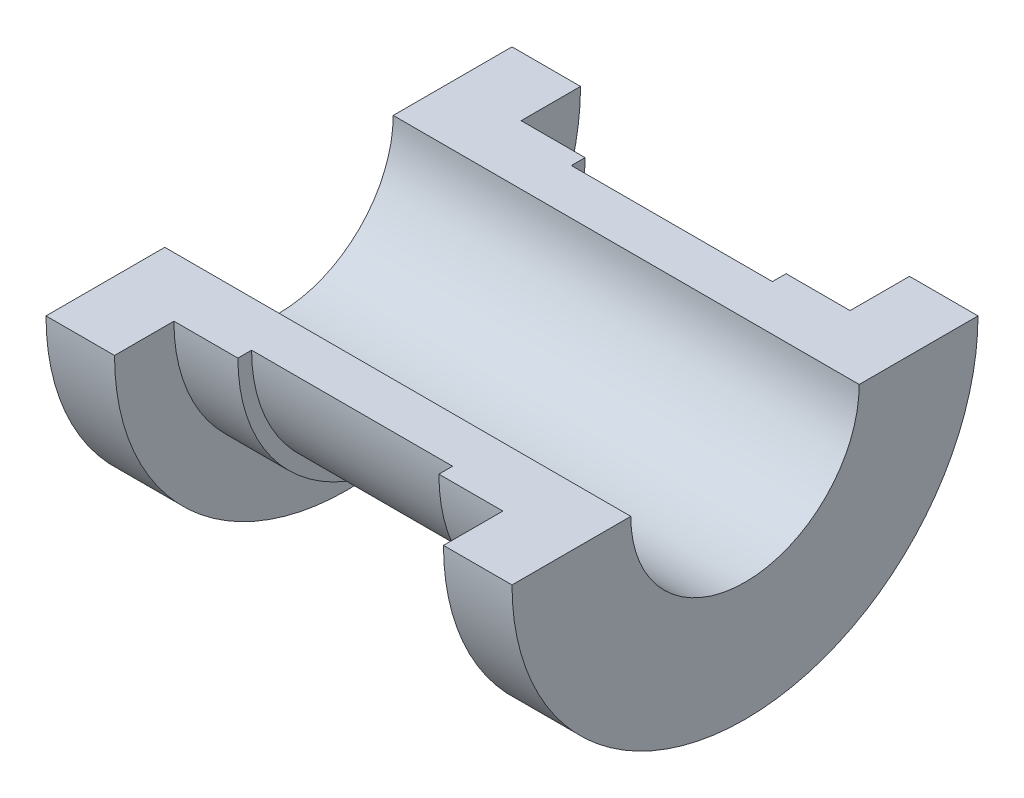
ISO-10303-21;
HEADER;
FILE_DESCRIPTION(('STEP AP214'),'2;1');
FILE_NAME('part.step','',(''),(''),'','','');
FILE_SCHEMA(('AUTOMOTIVE_DESIGN { 1 0 10303 214 1 1 1 1 }'));
ENDSEC;
DATA;
#1=APPLICATION_CONTEXT('core data for automotive mechanical design processes');
#2=APPLICATION_PROTOCOL_DEFINITION('international standard','automotive_design',2000,#1);
#3=PRODUCT_CONTEXT('',#1,'mechanical');
#4=PRODUCT('Part','Part','',(#3));
#5=PRODUCT_RELATED_PRODUCT_CATEGORY('part','',(#4));
#6=PRODUCT_DEFINITION_FORMATION('','',#4);
#7=PRODUCT_DEFINITION_CONTEXT('part definition',#1,'design');
#8=PRODUCT_DEFINITION('design','',#6,#7);
#9=PRODUCT_DEFINITION_SHAPE('','',#8);
#10=(LENGTH_UNIT() NAMED_UNIT(*) SI_UNIT(.MILLI.,.METRE.));
#11=(NAMED_UNIT(*) PLANE_ANGLE_UNIT() SI_UNIT($,.RADIAN.));
#12=(NAMED_UNIT(*) SI_UNIT($,.STERADIAN.) SOLID_ANGLE_UNIT());
#13=UNCERTAINTY_MEASURE_WITH_UNIT(LENGTH_MEASURE(1.E-05),#10,'distance_accuracy_value','');
#14=(GEOMETRIC_REPRESENTATION_CONTEXT(3) GLOBAL_UNCERTAINTY_ASSIGNED_CONTEXT((#13)) GLOBAL_UNIT_ASSIGNED_CONTEXT((#10,
#11,#12)) REPRESENTATION_CONTEXT('',''));
#15=CARTESIAN_POINT('',(0.,0.,0.));
#16=DIRECTION('',(0.,0.,1.));
#17=DIRECTION('',(1.,0.,0.));
#18=AXIS2_PLACEMENT_3D('',#15,#16,#17);
#19=CARTESIAN_POINT('',(25.5,0.,-12.5));
#20=DIRECTION('',(1.,0.,0.));
#21=DIRECTION('',(0.,0.,-1.));
#22=AXIS2_PLACEMENT_3D('',#19,#20,#21);
#23=PLANE('',#22);
#24=CARTESIAN_POINT('',(25.5,0.,0.));
#25=DIRECTION('',(-1.,0.,0.));
#26=DIRECTION('',(0.,0.,1.));
#27=AXIS2_PLACEMENT_3D('',#24,#25,#26);
#28=CIRCLE('',#27,25.5);
#29=CARTESIAN_POINT('',(25.5,0.,-25.5));
#30=VERTEX_POINT('',#29);
#31=CARTESIAN_POINT('',(25.5,0.,25.5));
#32=VERTEX_POINT('',#31);
#33=EDGE_CURVE('E50',#30,#32,#28,.T.);
#34=ORIENTED_EDGE('',*,*,#33,.F.);
#35=DIRECTION('',(0.,0.,1.));
#36=VECTOR('',#35,1.);
#37=CARTESIAN_POINT('',(25.5,0.,-12.5));
#38=LINE('',#37,#36);
#39=CARTESIAN_POINT('',(25.5,0.,-12.5));
#40=VERTEX_POINT('',#39);
#41=EDGE_CURVE('E133',#30,#40,#38,.T.);
#42=ORIENTED_EDGE('',*,*,#41,.T.);
#43=CARTESIAN_POINT('',(25.5,0.,0.));
#44=DIRECTION('',(-1.,0.,0.));
#45=DIRECTION('',(0.,0.,1.));
#46=AXIS2_PLACEMENT_3D('',#43,#44,#45);
#47=CIRCLE('',#46,12.5);
#48=CARTESIAN_POINT('',(25.5,0.,12.5));
#49=VERTEX_POINT('',#48);
#50=EDGE_CURVE('E128',#40,#49,#47,.T.);
#51=ORIENTED_EDGE('',*,*,#50,.T.);
#52=DIRECTION('',(0.,0.,-1.));
#53=VECTOR('',#52,1.);
#54=CARTESIAN_POINT('',(25.5,0.,12.5));
#55=LINE('',#54,#53);
#56=EDGE_CURVE('E131',#32,#49,#55,.T.);
#57=ORIENTED_EDGE('',*,*,#56,.F.);
#58=EDGE_LOOP('',(#34,#42,#51,#57));
#59=FACE_BOUND('',#58,.T.);
#60=ADVANCED_FACE('F38',(#59),#23,.T.);
#61=CARTESIAN_POINT('',(0.,0.,0.));
#62=DIRECTION('',(-1.,0.,0.));
#63=DIRECTION('',(0.,0.,1.));
#64=AXIS2_PLACEMENT_3D('',#61,#62,#63);
#65=CYLINDRICAL_SURFACE('',#64,25.5);
#66=CARTESIAN_POINT('',(18.,0.,0.));
#67=DIRECTION('',(-1.,0.,0.));
#68=DIRECTION('',(0.,0.,1.));
#69=AXIS2_PLACEMENT_3D('',#66,#67,#68);
#70=CIRCLE('',#69,25.5);
#71=CARTESIAN_POINT('',(18.,0.,-25.5));
#72=VERTEX_POINT('',#71);
#73=CARTESIAN_POINT('',(18.,0.,25.5));
#74=VERTEX_POINT('',#73);
#75=EDGE_CURVE('E63',#72,#74,#70,.T.);
#76=ORIENTED_EDGE('',*,*,#75,.F.);
#77=DIRECTION('',(1.,0.,0.));
#78=VECTOR('',#77,1.);
#79=CARTESIAN_POINT('',(25.5,0.,-25.5));
#80=LINE('',#79,#78);
#81=EDGE_CURVE('E138',#72,#30,#80,.T.);
#82=ORIENTED_EDGE('',*,*,#81,.T.);
#83=ORIENTED_EDGE('',*,*,#33,.T.);
#84=DIRECTION('',(1.,0.,0.));
#85=VECTOR('',#84,1.);
#86=CARTESIAN_POINT('',(25.5,0.,25.5));
#87=LINE('',#86,#85);
#88=EDGE_CURVE('E151',#74,#32,#87,.T.);
#89=ORIENTED_EDGE('',*,*,#88,.F.);
#90=EDGE_LOOP('',(#76,#82,#83,#89));
#91=FACE_BOUND('',#90,.T.);
#92=ADVANCED_FACE('F40',(#91),#65,.T.);
#93=CARTESIAN_POINT('',(18.,0.,-25.5));
#94=DIRECTION('',(-1.,0.,0.));
#95=DIRECTION('',(0.,0.,1.));
#96=AXIS2_PLACEMENT_3D('',#93,#94,#95);
#97=PLANE('',#96);
#98=CARTESIAN_POINT('',(18.,0.,0.));
#99=DIRECTION('',(-1.,0.,0.));
#100=DIRECTION('',(0.,0.,1.));
#101=AXIS2_PLACEMENT_3D('',#98,#99,#100);
#102=CIRCLE('',#101,19.);
#103=CARTESIAN_POINT('',(18.,0.,-19.));
#104=VERTEX_POINT('',#103);
#105=CARTESIAN_POINT('',(18.,0.,19.));
#106=VERTEX_POINT('',#105);
#107=EDGE_CURVE('E232',#104,#106,#102,.T.);
#108=ORIENTED_EDGE('',*,*,#107,.F.);
#109=DIRECTION('',(0.,0.,-1.));
#110=VECTOR('',#109,1.);
#111=CARTESIAN_POINT('',(18.,0.,-25.5));
#112=LINE('',#111,#110);
#113=EDGE_CURVE('E214',#104,#72,#112,.T.);
#114=ORIENTED_EDGE('',*,*,#113,.T.);
#115=ORIENTED_EDGE('',*,*,#75,.T.);
#116=DIRECTION('',(0.,0.,1.));
#117=VECTOR('',#116,1.);
#118=CARTESIAN_POINT('',(18.,0.,25.5));
#119=LINE('',#118,#117);
#120=EDGE_CURVE('E184',#106,#74,#119,.T.);
#121=ORIENTED_EDGE('',*,*,#120,.F.);
#122=EDGE_LOOP('',(#108,#114,#115,#121));
#123=FACE_BOUND('',#122,.T.);
#124=ADVANCED_FACE('F307',(#123),#97,.T.);
#125=CARTESIAN_POINT('',(0.,0.,0.));
#126=DIRECTION('',(-1.,0.,0.));
#127=DIRECTION('',(0.,0.,1.));
#128=AXIS2_PLACEMENT_3D('',#125,#126,#127);
#129=CYLINDRICAL_SURFACE('',#128,19.);
#130=CARTESIAN_POINT('',(11.,0.,0.));
#131=DIRECTION('',(-1.,0.,0.));
#132=DIRECTION('',(0.,0.,1.));
#133=AXIS2_PLACEMENT_3D('',#130,#131,#132);
#134=CIRCLE('',#133,19.);
#135=CARTESIAN_POINT('',(11.,0.,-19.));
#136=VERTEX_POINT('',#135);
#137=CARTESIAN_POINT('',(11.,0.,19.));
#138=VERTEX_POINT('',#137);
#139=EDGE_CURVE('E230',#136,#138,#134,.T.);
#140=ORIENTED_EDGE('',*,*,#139,.F.);
#141=DIRECTION('',(1.,0.,0.));
#142=VECTOR('',#141,1.);
#143=CARTESIAN_POINT('',(18.,0.,-19.));
#144=LINE('',#143,#142);
#145=EDGE_CURVE('E211',#136,#104,#144,.T.);
#146=ORIENTED_EDGE('',*,*,#145,.T.);
#147=ORIENTED_EDGE('',*,*,#107,.T.);
#148=DIRECTION('',(1.,0.,0.));
#149=VECTOR('',#148,1.);
#150=CARTESIAN_POINT('',(18.,0.,19.));
#151=LINE('',#150,#149);
#152=EDGE_CURVE('E181',#138,#106,#151,.T.);
#153=ORIENTED_EDGE('',*,*,#152,.F.);
#154=EDGE_LOOP('',(#140,#146,#147,#153));
#155=FACE_BOUND('',#154,.T.);
#156=ADVANCED_FACE('F304',(#155),#129,.T.);
#157=CARTESIAN_POINT('',(11.,0.,-19.));
#158=DIRECTION('',(-1.,0.,0.));
#159=DIRECTION('',(0.,0.,1.));
#160=AXIS2_PLACEMENT_3D('',#157,#158,#159);
#161=PLANE('',#160);
#162=CARTESIAN_POINT('',(11.,0.,0.));
#163=DIRECTION('',(-1.,0.,0.));
#164=DIRECTION('',(0.,0.,1.));
#165=AXIS2_PLACEMENT_3D('',#162,#163,#164);
#166=CIRCLE('',#165,17.5);
#167=CARTESIAN_POINT('',(11.,0.,-17.5));
#168=VERTEX_POINT('',#167);
#169=CARTESIAN_POINT('',(11.,0.,17.5));
#170=VERTEX_POINT('',#169);
#171=EDGE_CURVE('E228',#168,#170,#166,.T.);
#172=ORIENTED_EDGE('',*,*,#171,.F.);
#173=DIRECTION('',(0.,0.,-1.));
#174=VECTOR('',#173,1.);
#175=CARTESIAN_POINT('',(11.,0.,-19.));
#176=LINE('',#175,#174);
#177=EDGE_CURVE('E208',#168,#136,#176,.T.);
#178=ORIENTED_EDGE('',*,*,#177,.T.);
#179=ORIENTED_EDGE('',*,*,#139,.T.);
#180=DIRECTION('',(0.,0.,1.));
#181=VECTOR('',#180,1.);
#182=CARTESIAN_POINT('',(11.,0.,19.));
#183=LINE('',#182,#181);
#184=EDGE_CURVE('E178',#170,#138,#183,.T.);
#185=ORIENTED_EDGE('',*,*,#184,.F.);
#186=EDGE_LOOP('',(#172,#178,#179,#185));
#187=FACE_BOUND('',#186,.T.);
#188=ADVANCED_FACE('F301',(#187),#161,.T.);
#189=CARTESIAN_POINT('',(0.,0.,0.));
#190=DIRECTION('',(-1.,0.,0.));
#191=DIRECTION('',(0.,0.,1.));
#192=AXIS2_PLACEMENT_3D('',#189,#190,#191);
#193=CYLINDRICAL_SURFACE('',#192,17.5);
#194=CARTESIAN_POINT('',(0.,-17.2434862639043,2.98532769835149));
#195=CARTESIAN_POINT('',(-0.393250882339083,-17.243440773825,2.98559045260708));
#196=CARTESIAN_POINT('',(-0.781759879061474,-17.2571008429751,2.90950813701106));
#197=CARTESIAN_POINT('',(-1.51107048678248,-17.3047039270003,2.61151088506312));
#198=CARTESIAN_POINT('',(-1.83907500398646,-17.3374866995625,2.39593028336162));
#199=CARTESIAN_POINT('',(-2.40153121465639,-17.4054597338849,1.8381780197645));
#200=CARTESIAN_POINT('',(-2.61999696772943,-17.4383946077719,1.51157635169592));
#201=CARTESIAN_POINT('',(-2.9221664876013,-17.4861631645221,0.785218025191185));
#202=CARTESIAN_POINT('',(-2.99978309080483,-17.4999747284957,0.394490958287499));
#203=CARTESIAN_POINT('',(-3.00020313103649,-17.5000251994827,-0.392245626652773));
#204=CARTESIAN_POINT('',(-2.92233201420616,-17.4861935264983,-0.78410277436104));
#205=CARTESIAN_POINT('',(-2.62165153745049,-17.4386345936882,-1.5085770496508));
#206=CARTESIAN_POINT('',(-2.40032413043669,-17.4053220941262,-1.83909902073129));
#207=CARTESIAN_POINT('',(-1.84342457074535,-17.3380065042287,-2.39187225153384));
#208=CARTESIAN_POINT('',(-1.51348120622272,-17.3048706613046,-2.61042075372896));
#209=CARTESIAN_POINT('',(-0.784003911064598,-17.2572004955497,-2.90893041724563));
#210=CARTESIAN_POINT('',(-0.395104830968694,-17.2435181087001,-2.98514375608328));
#211=CARTESIAN_POINT('',(0.393613175412539,-17.2434847658635,-2.9853363527388));
#212=CARTESIAN_POINT('',(0.783376866372402,-17.2571907578095,-2.90895717093594));
#213=CARTESIAN_POINT('',(1.5113813405387,-17.3046829255837,-2.61163043303959));
#214=CARTESIAN_POINT('',(1.84278628882435,-17.3379189202925,-2.39244434106502));
#215=CARTESIAN_POINT('',(2.39890969888057,-17.4051393723031,-1.84074600160805));
#216=CARTESIAN_POINT('',(2.62104876144961,-17.438508578781,-1.51005136766377));
#217=CARTESIAN_POINT('',(2.92175382118625,-17.4861356033571,-0.785428702179635));
#218=CARTESIAN_POINT('',(2.99998595384842,-17.4999912256025,-0.394447010517847));
#219=CARTESIAN_POINT('',(2.99986469458536,-17.5000087657294,0.393668057711066));
#220=CARTESIAN_POINT('',(2.92275700453421,-17.4862869021787,0.782890988630951));
#221=CARTESIAN_POINT('',(2.62049196210539,-17.438454426257,1.51111056800696));
#222=CARTESIAN_POINT('',(2.40026616193574,-17.4053491401306,1.83894587814236));
#223=CARTESIAN_POINT('',(1.84233397022099,-17.3378529736346,2.39306391415099));
#224=CARTESIAN_POINT('',(1.51177026940513,-17.3047473510918,2.61121309366963));
#225=CARTESIAN_POINT('',(0.784438180191088,-17.2572071508298,2.90886851868887));
#226=CARTESIAN_POINT('',(0.393250882339083,-17.2435317539835,2.98506494409589));
#227=CARTESIAN_POINT('',(0.,-17.2434862639043,2.98532769835149));
#228=B_SPLINE_CURVE_WITH_KNOTS('',3,(#194,#195,#196,#197,#198,#199,#200,#201,#202,#203,#204,
#205,#206,#207,#208,#209,#210,#211,#212,#213,#214,#215,#216,#217,#218,#219,#220,#221,#222,#223,
#224,#225,#226,#227),.UNSPECIFIED.,.T.,.F.,(4,2,2,2,2,2,2,2,2,2,2,2,2,2,2,2,4),(0.,0.0625,0.125,
0.1875,0.25,0.3125,0.375,0.4375,0.5,0.5625,0.625,0.6875,0.75,0.8125,0.875,0.9375,1.),.UNSPECIFIED.);
#229=CARTESIAN_POINT('',(0.,-17.2434862639043,2.98532769835149));
#230=VERTEX_POINT('',#229);
#231=EDGE_CURVE('E12',#230,#230,#228,.T.);
#232=ORIENTED_EDGE('',*,*,#231,.F.);
#233=EDGE_LOOP('',(#232));
#234=FACE_BOUND('',#233,.T.);
#235=CARTESIAN_POINT('',(-11.,0.,0.));
#236=DIRECTION('',(-1.,0.,0.));
#237=DIRECTION('',(0.,0.,1.));
#238=AXIS2_PLACEMENT_3D('',#235,#236,#237);
#239=CIRCLE('',#238,17.5);
#240=CARTESIAN_POINT('',(-11.,0.,-17.5));
#241=VERTEX_POINT('',#240);
#242=CARTESIAN_POINT('',(-11.,0.,17.5));
#243=VERTEX_POINT('',#242);
#244=EDGE_CURVE('E226',#241,#243,#239,.T.);
#245=ORIENTED_EDGE('',*,*,#244,.F.);
#246=DIRECTION('',(1.,0.,0.));
#247=VECTOR('',#246,1.);
#248=CARTESIAN_POINT('',(11.,0.,-17.5));
#249=LINE('',#248,#247);
#250=EDGE_CURVE('E205',#241,#168,#249,.T.);
#251=ORIENTED_EDGE('',*,*,#250,.T.);
#252=ORIENTED_EDGE('',*,*,#171,.T.);
#253=DIRECTION('',(1.,0.,0.));
#254=VECTOR('',#253,1.);
#255=CARTESIAN_POINT('',(11.,0.,17.5));
#256=LINE('',#255,#254);
#257=EDGE_CURVE('E175',#243,#170,#256,.T.);
#258=ORIENTED_EDGE('',*,*,#257,.F.);
#259=EDGE_LOOP('',(#245,#251,#252,#258));
#260=FACE_BOUND('',#259,.T.);
#261=ADVANCED_FACE('F237',(#234,#260),#193,.T.);
#262=CARTESIAN_POINT('',(-11.,0.,-17.5));
#263=DIRECTION('',(1.,0.,0.));
#264=DIRECTION('',(0.,0.,-1.));
#265=AXIS2_PLACEMENT_3D('',#262,#263,#264);
#266=PLANE('',#265);
#267=CARTESIAN_POINT('',(-11.,0.,0.));
#268=DIRECTION('',(-1.,0.,0.));
#269=DIRECTION('',(0.,0.,1.));
#270=AXIS2_PLACEMENT_3D('',#267,#268,#269);
#271=CIRCLE('',#270,19.);
#272=CARTESIAN_POINT('',(-11.,0.,-19.));
#273=VERTEX_POINT('',#272);
#274=CARTESIAN_POINT('',(-11.,0.,19.));
#275=VERTEX_POINT('',#274);
#276=EDGE_CURVE('E224',#273,#275,#271,.T.);
#277=ORIENTED_EDGE('',*,*,#276,.F.);
#278=DIRECTION('',(0.,0.,1.));
#279=VECTOR('',#278,1.);
#280=CARTESIAN_POINT('',(-11.,0.,-17.5));
#281=LINE('',#280,#279);
#282=EDGE_CURVE('E202',#273,#241,#281,.T.);
#283=ORIENTED_EDGE('',*,*,#282,.T.);
#284=ORIENTED_EDGE('',*,*,#244,.T.);
#285=DIRECTION('',(0.,0.,-1.));
#286=VECTOR('',#285,1.);
#287=CARTESIAN_POINT('',(-11.,0.,17.5));
#288=LINE('',#287,#286);
#289=EDGE_CURVE('E172',#275,#243,#288,.T.);
#290=ORIENTED_EDGE('',*,*,#289,.F.);
#291=EDGE_LOOP('',(#277,#283,#284,#290));
#292=FACE_BOUND('',#291,.T.);
#293=ADVANCED_FACE('F294',(#292),#266,.T.);
#294=CARTESIAN_POINT('',(0.,0.,0.));
#295=DIRECTION('',(-1.,0.,0.));
#296=DIRECTION('',(0.,0.,1.));
#297=AXIS2_PLACEMENT_3D('',#294,#295,#296);
#298=CYLINDRICAL_SURFACE('',#297,19.);
#299=CARTESIAN_POINT('',(-18.,0.,0.));
#300=DIRECTION('',(-1.,0.,0.));
#301=DIRECTION('',(0.,0.,1.));
#302=AXIS2_PLACEMENT_3D('',#299,#300,#301);
#303=CIRCLE('',#302,19.);
#304=CARTESIAN_POINT('',(-18.,0.,-19.));
#305=VERTEX_POINT('',#304);
#306=CARTESIAN_POINT('',(-18.,0.,19.));
#307=VERTEX_POINT('',#306);
#308=EDGE_CURVE('E222',#305,#307,#303,.T.);
#309=ORIENTED_EDGE('',*,*,#308,.F.);
#310=DIRECTION('',(1.,0.,0.));
#311=VECTOR('',#310,1.);
#312=CARTESIAN_POINT('',(-18.,0.,-19.));
#313=LINE('',#312,#311);
#314=EDGE_CURVE('E199',#305,#273,#313,.T.);
#315=ORIENTED_EDGE('',*,*,#314,.T.);
#316=ORIENTED_EDGE('',*,*,#276,.T.);
#317=DIRECTION('',(1.,0.,0.));
#318=VECTOR('',#317,1.);
#319=CARTESIAN_POINT('',(-18.,0.,19.));
#320=LINE('',#319,#318);
#321=EDGE_CURVE('E169',#307,#275,#320,.T.);
#322=ORIENTED_EDGE('',*,*,#321,.F.);
#323=EDGE_LOOP('',(#309,#315,#316,#322));
#324=FACE_BOUND('',#323,.T.);
#325=ADVANCED_FACE('F290',(#324),#298,.T.);
#326=CARTESIAN_POINT('',(-18.,0.,-25.5));
#327=DIRECTION('',(1.,0.,0.));
#328=DIRECTION('',(0.,0.,-1.));
#329=AXIS2_PLACEMENT_3D('',#326,#327,#328);
#330=PLANE('',#329);
#331=CARTESIAN_POINT('',(-18.,0.,0.));
#332=DIRECTION('',(-1.,0.,0.));
#333=DIRECTION('',(0.,0.,1.));
#334=AXIS2_PLACEMENT_3D('',#331,#332,#333);
#335=CIRCLE('',#334,25.5);
#336=CARTESIAN_POINT('',(-18.,0.,-25.5));
#337=VERTEX_POINT('',#336);
#338=CARTESIAN_POINT('',(-18.,0.,25.5));
#339=VERTEX_POINT('',#338);
#340=EDGE_CURVE('E220',#337,#339,#335,.T.);
#341=ORIENTED_EDGE('',*,*,#340,.F.);
#342=DIRECTION('',(0.,0.,1.));
#343=VECTOR('',#342,1.);
#344=CARTESIAN_POINT('',(-18.,0.,-25.5));
#345=LINE('',#344,#343);
#346=EDGE_CURVE('E196',#337,#305,#345,.T.);
#347=ORIENTED_EDGE('',*,*,#346,.T.);
#348=ORIENTED_EDGE('',*,*,#308,.T.);
#349=DIRECTION('',(0.,0.,-1.));
#350=VECTOR('',#349,1.);
#351=CARTESIAN_POINT('',(-18.,0.,25.5));
#352=LINE('',#351,#350);
#353=EDGE_CURVE('E166',#339,#307,#352,.T.);
#354=ORIENTED_EDGE('',*,*,#353,.F.);
#355=EDGE_LOOP('',(#341,#347,#348,#354));
#356=FACE_BOUND('',#355,.T.);
#357=ADVANCED_FACE('F286',(#356),#330,.T.);
#358=CARTESIAN_POINT('',(0.,0.,0.));
#359=DIRECTION('',(-1.,0.,0.));
#360=DIRECTION('',(0.,0.,1.));
#361=AXIS2_PLACEMENT_3D('',#358,#359,#360);
#362=CYLINDRICAL_SURFACE('',#361,25.5);
#363=CARTESIAN_POINT('',(-25.5,0.,0.));
#364=DIRECTION('',(-1.,0.,0.));
#365=DIRECTION('',(0.,0.,1.));
#366=AXIS2_PLACEMENT_3D('',#363,#364,#365);
#367=CIRCLE('',#366,25.5);
#368=CARTESIAN_POINT('',(-25.5,0.,-25.5));
#369=VERTEX_POINT('',#368);
#370=CARTESIAN_POINT('',(-25.5,0.,25.5));
#371=VERTEX_POINT('',#370);
#372=EDGE_CURVE('E218',#369,#371,#367,.T.);
#373=ORIENTED_EDGE('',*,*,#372,.F.);
#374=DIRECTION('',(1.,0.,0.));
#375=VECTOR('',#374,1.);
#376=CARTESIAN_POINT('',(-25.5,0.,-25.5));
#377=LINE('',#376,#375);
#378=EDGE_CURVE('E193',#369,#337,#377,.T.);
#379=ORIENTED_EDGE('',*,*,#378,.T.);
#380=ORIENTED_EDGE('',*,*,#340,.T.);
#381=DIRECTION('',(1.,0.,0.));
#382=VECTOR('',#381,1.);
#383=CARTESIAN_POINT('',(-25.5,0.,25.5));
#384=LINE('',#383,#382);
#385=EDGE_CURVE('E163',#371,#339,#384,.T.);
#386=ORIENTED_EDGE('',*,*,#385,.F.);
#387=EDGE_LOOP('',(#373,#379,#380,#386));
#388=FACE_BOUND('',#387,.T.);
#389=ADVANCED_FACE('F282',(#388),#362,.T.);
#390=CARTESIAN_POINT('',(-25.5,0.,-12.5));
#391=DIRECTION('',(-1.,0.,0.));
#392=DIRECTION('',(0.,0.,1.));
#393=AXIS2_PLACEMENT_3D('',#390,#391,#392);
#394=PLANE('',#393);
#395=CARTESIAN_POINT('',(-25.5,0.,0.));
#396=DIRECTION('',(-1.,0.,0.));
#397=DIRECTION('',(0.,0.,1.));
#398=AXIS2_PLACEMENT_3D('',#395,#396,#397);
#399=CIRCLE('',#398,12.5);
#400=CARTESIAN_POINT('',(-25.5,0.,-12.5));
#401=VERTEX_POINT('',#400);
#402=CARTESIAN_POINT('',(-25.5,0.,12.5));
#403=VERTEX_POINT('',#402);
#404=EDGE_CURVE('E137',#401,#403,#399,.T.);
#405=ORIENTED_EDGE('',*,*,#404,.F.);
#406=DIRECTION('',(0.,0.,-1.));
#407=VECTOR('',#406,1.);
#408=CARTESIAN_POINT('',(-25.5,0.,-12.5));
#409=LINE('',#408,#407);
#410=EDGE_CURVE('E190',#401,#369,#409,.T.);
#411=ORIENTED_EDGE('',*,*,#410,.T.);
#412=ORIENTED_EDGE('',*,*,#372,.T.);
#413=DIRECTION('',(0.,0.,1.));
#414=VECTOR('',#413,1.);
#415=CARTESIAN_POINT('',(-25.5,0.,12.5));
#416=LINE('',#415,#414);
#417=EDGE_CURVE('E146',#403,#371,#416,.T.);
#418=ORIENTED_EDGE('',*,*,#417,.F.);
#419=EDGE_LOOP('',(#405,#411,#412,#418));
#420=FACE_BOUND('',#419,.T.);
#421=ADVANCED_FACE('F279',(#420),#394,.T.);
#422=CARTESIAN_POINT('',(0.,0.,0.));
#423=DIRECTION('',(-1.,0.,0.));
#424=DIRECTION('',(0.,0.,1.));
#425=AXIS2_PLACEMENT_3D('',#422,#423,#424);
#426=CYLINDRICAL_SURFACE('',#425,12.5);
#427=DIRECTION('',(-1.,0.,0.));
#428=VECTOR('',#427,1.);
#429=CARTESIAN_POINT('',(-25.5,0.,-12.5));
#430=LINE('',#429,#428);
#431=EDGE_CURVE('E188',#40,#401,#430,.T.);
#432=ORIENTED_EDGE('',*,*,#431,.T.);
#433=ORIENTED_EDGE('',*,*,#404,.T.);
#434=DIRECTION('',(-1.,0.,0.));
#435=VECTOR('',#434,1.);
#436=CARTESIAN_POINT('',(-25.5,0.,12.5));
#437=LINE('',#436,#435);
#438=EDGE_CURVE('E141',#49,#403,#437,.T.);
#439=ORIENTED_EDGE('',*,*,#438,.F.);
#440=ORIENTED_EDGE('',*,*,#50,.F.);
#441=EDGE_LOOP('',(#432,#433,#439,#440));
#442=FACE_BOUND('',#441,.T.);
#443=ADVANCED_FACE('F142',(#442),#426,.F.);
#444=CARTESIAN_POINT('',(0.,0.,0.));
#445=DIRECTION('',(0.,1.,0.));
#446=DIRECTION('',(-1.,0.,0.));
#447=AXIS2_PLACEMENT_3D('',#444,#445,#446);
#448=PLANE('',#447);
#449=ORIENTED_EDGE('',*,*,#41,.F.);
#450=ORIENTED_EDGE('',*,*,#81,.F.);
#451=ORIENTED_EDGE('',*,*,#113,.F.);
#452=ORIENTED_EDGE('',*,*,#145,.F.);
#453=ORIENTED_EDGE('',*,*,#177,.F.);
#454=ORIENTED_EDGE('',*,*,#250,.F.);
#455=ORIENTED_EDGE('',*,*,#282,.F.);
#456=ORIENTED_EDGE('',*,*,#314,.F.);
#457=ORIENTED_EDGE('',*,*,#346,.F.);
#458=ORIENTED_EDGE('',*,*,#378,.F.);
#459=ORIENTED_EDGE('',*,*,#410,.F.);
#460=ORIENTED_EDGE('',*,*,#431,.F.);
#461=EDGE_LOOP('',(#449,#450,#451,#452,#453,#454,#455,#456,#457,#458,#459,#460));
#462=FACE_BOUND('',#461,.T.);
#463=ADVANCED_FACE('F271',(#462),#448,.T.);
#464=CARTESIAN_POINT('',(0.,0.,0.));
#465=DIRECTION('',(0.,-1.,0.));
#466=DIRECTION('',(-1.,0.,0.));
#467=AXIS2_PLACEMENT_3D('',#464,#465,#466);
#468=PLANE('',#467);
#469=ORIENTED_EDGE('',*,*,#56,.T.);
#470=ORIENTED_EDGE('',*,*,#438,.T.);
#471=ORIENTED_EDGE('',*,*,#417,.T.);
#472=ORIENTED_EDGE('',*,*,#385,.T.);
#473=ORIENTED_EDGE('',*,*,#353,.T.);
#474=ORIENTED_EDGE('',*,*,#321,.T.);
#475=ORIENTED_EDGE('',*,*,#289,.T.);
#476=ORIENTED_EDGE('',*,*,#257,.T.);
#477=ORIENTED_EDGE('',*,*,#184,.T.);
#478=ORIENTED_EDGE('',*,*,#152,.T.);
#479=ORIENTED_EDGE('',*,*,#120,.T.);
#480=ORIENTED_EDGE('',*,*,#88,.T.);
#481=EDGE_LOOP('',(#469,#470,#471,#472,#473,#474,#475,#476,#477,#478,#479,#480));
#482=FACE_BOUND('',#481,.T.);
#483=ADVANCED_FACE('F149',(#482),#468,.F.);
#484=CARTESIAN_POINT('',(0.,-23.1555386972429,4.00886862350057));
#485=CARTESIAN_POINT('',(0.393250882339083,-23.1555997839208,4.00851578207163));
#486=CARTESIAN_POINT('',(0.784438180191088,-23.1739638882572,3.90619486795363));
#487=CARTESIAN_POINT('',(1.51177026940513,-23.2378035857519,3.50648615435636));
#488=CARTESIAN_POINT('',(1.84233397022099,-23.2822597074521,3.21354297043133));
#489=CARTESIAN_POINT('',(2.40026616193574,-23.3728974167468,2.46944160779117));
#490=CARTESIAN_POINT('',(2.62049196210539,-23.417353086688,2.02920561989505));
#491=CARTESIAN_POINT('',(2.92275700453421,-23.4815852686399,1.05131075616156));
#492=CARTESIAN_POINT('',(2.99986469458536,-23.5000117711224,0.528639963212003));
#493=CARTESIAN_POINT('',(2.99998595384842,-23.4999882172376,-0.529685985552538));
#494=CARTESIAN_POINT('',(2.92175382118625,-23.4813820959367,-1.05471854292694));
#495=CARTESIAN_POINT('',(2.62104876144961,-23.4174258057916,-2.02778326514849));
#496=CARTESIAN_POINT('',(2.39890969888057,-23.3726157285213,-2.4718589164451));
#497=CARTESIAN_POINT('',(1.84278628882435,-23.2823482643928,-3.21271097228731));
#498=CARTESIAN_POINT('',(1.5113813405387,-23.2377170714981,-3.50704658151031));
#499=CARTESIAN_POINT('',(0.783376866372402,-23.1739418747728,-3.90631391525684));
#500=CARTESIAN_POINT('',(0.393613175412539,-23.1555366855882,-4.00888024510639));
#501=CARTESIAN_POINT('',(-0.395104830968694,-23.1555814602544,-4.00862161531183));
#502=CARTESIAN_POINT('',(-0.784003911064598,-23.1739549511668,-3.9062779888727));
#503=CARTESIAN_POINT('',(-1.51348120622272,-23.2379691737519,-3.50542215500747));
#504=CARTESIAN_POINT('',(-1.84342457074535,-23.2824658771071,-3.21194273777401));
#505=CARTESIAN_POINT('',(-2.40032413043669,-23.3728610978267,-2.46964725641058));
#506=CARTESIAN_POINT('',(-2.62165153745049,-23.4175950258099,-2.02580346667393));
#507=CARTESIAN_POINT('',(-2.92233201420616,-23.4814598784406,-1.05293801128482));
#508=CARTESIAN_POINT('',(-3.00020313103649,-23.5000338393053,-0.526729841505152));
#509=CARTESIAN_POINT('',(-2.99978309080483,-23.4999660639799,0.529745001128927));
#510=CARTESIAN_POINT('',(-2.9221664876013,-23.4814191066439,1.05443563382816));
#511=CARTESIAN_POINT('',(-2.61999696772943,-23.417272759008,2.02983110084881));
#512=CARTESIAN_POINT('',(-2.40153121465639,-23.3730459283598,2.46841048368376));
#513=CARTESIAN_POINT('',(-1.83907500398646,-23.2817678536982,3.21739209479989));
#514=CARTESIAN_POINT('',(-1.51107048678248,-23.2377452734005,3.50688604565619));
#515=CARTESIAN_POINT('',(-0.781759879061474,-23.1738211319951,3.90705378398628));
#516=CARTESIAN_POINT('',(-0.393250882339083,-23.155477610565,4.00922146492951));
#517=CARTESIAN_POINT('',(0.,-23.1555386972429,4.00886862350057));
#518=CARTESIAN_POINT('',(0.,-17.2434862639043,2.98532769835149));
#519=CARTESIAN_POINT('',(0.393250882339083,-17.2435317539835,2.98506494409589));
#520=CARTESIAN_POINT('',(0.784438180191088,-17.2572071508298,2.90886851868887));
#521=CARTESIAN_POINT('',(1.51177026940513,-17.3047473510918,2.61121309366963));
#522=CARTESIAN_POINT('',(1.84233397022099,-17.3378529736346,2.39306391415099));
#523=CARTESIAN_POINT('',(2.40026616193574,-17.4053491401306,1.83894587814236));
#524=CARTESIAN_POINT('',(2.62049196210539,-17.438454426257,1.51111056800696));
#525=CARTESIAN_POINT('',(2.92275700453421,-17.4862869021787,0.782890988630951));
#526=CARTESIAN_POINT('',(2.99986469458536,-17.5000087657294,0.393668057711066));
#527=CARTESIAN_POINT('',(2.99998595384842,-17.4999912256025,-0.394447010517847));
#528=CARTESIAN_POINT('',(2.92175382118625,-17.4861356033571,-0.785428702179635));
#529=CARTESIAN_POINT('',(2.62104876144961,-17.438508578781,-1.51005136766377));
#530=CARTESIAN_POINT('',(2.39890969888057,-17.4051393723031,-1.84074600160805));
#531=CARTESIAN_POINT('',(1.84278628882435,-17.3379189202925,-2.39244434106502));
#532=CARTESIAN_POINT('',(1.5113813405387,-17.3046829255837,-2.61163043303959));
#533=CARTESIAN_POINT('',(0.783376866372402,-17.2571907578095,-2.90895717093594));
#534=CARTESIAN_POINT('',(0.393613175412539,-17.2434847658635,-2.9853363527388));
#535=CARTESIAN_POINT('',(-0.395104830968694,-17.2435181087001,-2.98514375608328));
#536=CARTESIAN_POINT('',(-0.784003911064598,-17.2572004955497,-2.90893041724563));
#537=CARTESIAN_POINT('',(-1.51348120622272,-17.3048706613046,-2.61042075372896));
#538=CARTESIAN_POINT('',(-1.84342457074535,-17.3380065042287,-2.39187225153384));
#539=CARTESIAN_POINT('',(-2.40032413043669,-17.4053220941262,-1.83909902073129));
#540=CARTESIAN_POINT('',(-2.62165153745049,-17.4386345936882,-1.5085770496508));
#541=CARTESIAN_POINT('',(-2.92233201420616,-17.4861935264983,-0.78410277436104));
#542=CARTESIAN_POINT('',(-3.00020313103649,-17.5000251994827,-0.392245626652773));
#543=CARTESIAN_POINT('',(-2.99978309080483,-17.4999747284957,0.394490958287499));
#544=CARTESIAN_POINT('',(-2.9221664876013,-17.4861631645221,0.785218025191185));
#545=CARTESIAN_POINT('',(-2.61999696772943,-17.4383946077719,1.51157635169592));
#546=CARTESIAN_POINT('',(-2.40153121465639,-17.4054597338849,1.8381780197645));
#547=CARTESIAN_POINT('',(-1.83907500398646,-17.3374866995625,2.39593028336162));
#548=CARTESIAN_POINT('',(-1.51107048678248,-17.3047039270003,2.61151088506312));
#549=CARTESIAN_POINT('',(-0.781759879061474,-17.2571008429751,2.90950813701106));
#550=CARTESIAN_POINT('',(-0.393250882339083,-17.243440773825,2.98559045260708));
#551=CARTESIAN_POINT('',(0.,-17.2434862639043,2.98532769835149));
#552=B_SPLINE_SURFACE_WITH_KNOTS('',1,3,((#484,#485,#486,#487,#488,#489,#490,#491,#492,#493,
#494,#495,#496,#497,#498,#499,#500,#501,#502,#503,#504,#505,#506,#507,#508,#509,#510,#511,#512,
#513,#514,#515,#516,#517),(#518,#519,#520,#521,#522,#523,#524,#525,#526,#527,#528,#529,#530,
#531,#532,#533,#534,#535,#536,#537,#538,#539,#540,#541,#542,#543,#544,#545,#546,#547,#548,#549,
#550,#551)),.UNSPECIFIED.,.F.,.T.,.F.,(2,2),(4,2,2,2,2,2,2,2,2,2,2,2,2,2,2,2,4),(0.,1.),(0.,
0.0625,0.125,0.1875,0.25,0.3125,0.375,0.4375,0.5,0.5625,0.625,0.6875,0.75,0.8125,0.875,0.9375,
1.),.UNSPECIFIED.);
#553=CARTESIAN_POINT('',(0.,-23.1555386972429,4.00886862350057));
#554=CARTESIAN_POINT('',(0.393250882339083,-23.1555997839208,4.00851578207163));
#555=CARTESIAN_POINT('',(0.784438180191088,-23.1739638882572,3.90619486795363));
#556=CARTESIAN_POINT('',(1.51177026940513,-23.2378035857519,3.50648615435636));
#557=CARTESIAN_POINT('',(1.84233397022099,-23.2822597074521,3.21354297043133));
#558=CARTESIAN_POINT('',(2.40026616193574,-23.3728974167468,2.46944160779117));
#559=CARTESIAN_POINT('',(2.62049196210539,-23.417353086688,2.02920561989505));
#560=CARTESIAN_POINT('',(2.92275700453421,-23.4815852686399,1.05131075616156));
#561=CARTESIAN_POINT('',(2.99986469458536,-23.5000117711224,0.528639963212003));
#562=CARTESIAN_POINT('',(2.99998595384842,-23.4999882172376,-0.529685985552538));
#563=CARTESIAN_POINT('',(2.92175382118625,-23.4813820959367,-1.05471854292694));
#564=CARTESIAN_POINT('',(2.62104876144961,-23.4174258057916,-2.02778326514849));
#565=CARTESIAN_POINT('',(2.39890969888057,-23.3726157285213,-2.4718589164451));
#566=CARTESIAN_POINT('',(1.84278628882435,-23.2823482643928,-3.21271097228731));
#567=CARTESIAN_POINT('',(1.5113813405387,-23.2377170714981,-3.50704658151031));
#568=CARTESIAN_POINT('',(0.783376866372402,-23.1739418747728,-3.90631391525684));
#569=CARTESIAN_POINT('',(0.393613175412539,-23.1555366855882,-4.00888024510639));
#570=CARTESIAN_POINT('',(-0.395104830968694,-23.1555814602544,-4.00862161531183));
#571=CARTESIAN_POINT('',(-0.784003911064598,-23.1739549511668,-3.9062779888727));
#572=CARTESIAN_POINT('',(-1.51348120622272,-23.2379691737519,-3.50542215500747));
#573=CARTESIAN_POINT('',(-1.84342457074535,-23.2824658771071,-3.21194273777401));
#574=CARTESIAN_POINT('',(-2.40032413043669,-23.3728610978267,-2.46964725641058));
#575=CARTESIAN_POINT('',(-2.62165153745049,-23.4175950258099,-2.02580346667393));
#576=CARTESIAN_POINT('',(-2.92233201420616,-23.4814598784406,-1.05293801128482));
#577=CARTESIAN_POINT('',(-3.00020313103649,-23.5000338393053,-0.526729841505152));
#578=CARTESIAN_POINT('',(-2.99978309080483,-23.4999660639799,0.529745001128927));
#579=CARTESIAN_POINT('',(-2.9221664876013,-23.4814191066439,1.05443563382816));
#580=CARTESIAN_POINT('',(-2.61999696772943,-23.417272759008,2.02983110084881));
#581=CARTESIAN_POINT('',(-2.40153121465639,-23.3730459283598,2.46841048368376));
#582=CARTESIAN_POINT('',(-1.83907500398646,-23.2817678536982,3.21739209479989));
#583=CARTESIAN_POINT('',(-1.51107048678248,-23.2377452734005,3.50688604565619));
#584=CARTESIAN_POINT('',(-0.781759879061474,-23.1738211319951,3.90705378398628));
#585=CARTESIAN_POINT('',(-0.393250882339083,-23.155477610565,4.00922146492951));
#586=CARTESIAN_POINT('',(0.,-23.1555386972429,4.00886862350057));
#587=B_SPLINE_CURVE_WITH_KNOTS('',3,(#553,#554,#555,#556,#557,#558,#559,#560,#561,#562,#563,
#564,#565,#566,#567,#568,#569,#570,#571,#572,#573,#574,#575,#576,#577,#578,#579,#580,#581,#582,
#583,#584,#585,#586),.UNSPECIFIED.,.T.,.F.,(4,2,2,2,2,2,2,2,2,2,2,2,2,2,2,2,4),(0.,0.0625,0.125,
0.1875,0.25,0.3125,0.375,0.4375,0.5,0.5625,0.625,0.6875,0.75,0.8125,0.875,0.9375,1.),.UNSPECIFIED.);
#588=CARTESIAN_POINT('',(0.,-23.1555386972429,4.00886862350057));
#589=VERTEX_POINT('',#588);
#590=EDGE_CURVE('E152',#589,#589,#587,.T.);
#591=ORIENTED_EDGE('',*,*,#231,.T.);
#592=EDGE_LOOP('',(#591));
#593=FACE_BOUND('',#592,.T.);
#594=ORIENTED_EDGE('',*,*,#590,.T.);
#595=EDGE_LOOP('',(#594));
#596=FACE_BOUND('',#595,.T.);
#597=ADVANCED_FACE('F241',(#593,#596),#552,.F.);
#598=CARTESIAN_POINT('',(0.,0.,0.));
#599=DIRECTION('',(-1.,0.,0.));
#600=DIRECTION('',(0.,0.,1.));
#601=AXIS2_PLACEMENT_3D('',#598,#599,#600);
#602=CYLINDRICAL_SURFACE('',#601,23.5);
#603=ORIENTED_EDGE('',*,*,#590,.F.);
#604=EDGE_LOOP('',(#603));
#605=FACE_BOUND('',#604,.T.);
#606=ADVANCED_FACE('F261',(#605),#602,.T.);
#607=CLOSED_SHELL('',(#60,#92,#124,#156,#188,#261,#293,#325,#357,#389,#421,#443,#463,#483,#597,#606));
#608=MANIFOLD_SOLID_BREP('B2',#607);
#609=ADVANCED_BREP_SHAPE_REPRESENTATION('',(#18,#608),#14);
#610=SHAPE_DEFINITION_REPRESENTATION(#9,#609);
ENDSEC;
END-ISO-10303-21;
